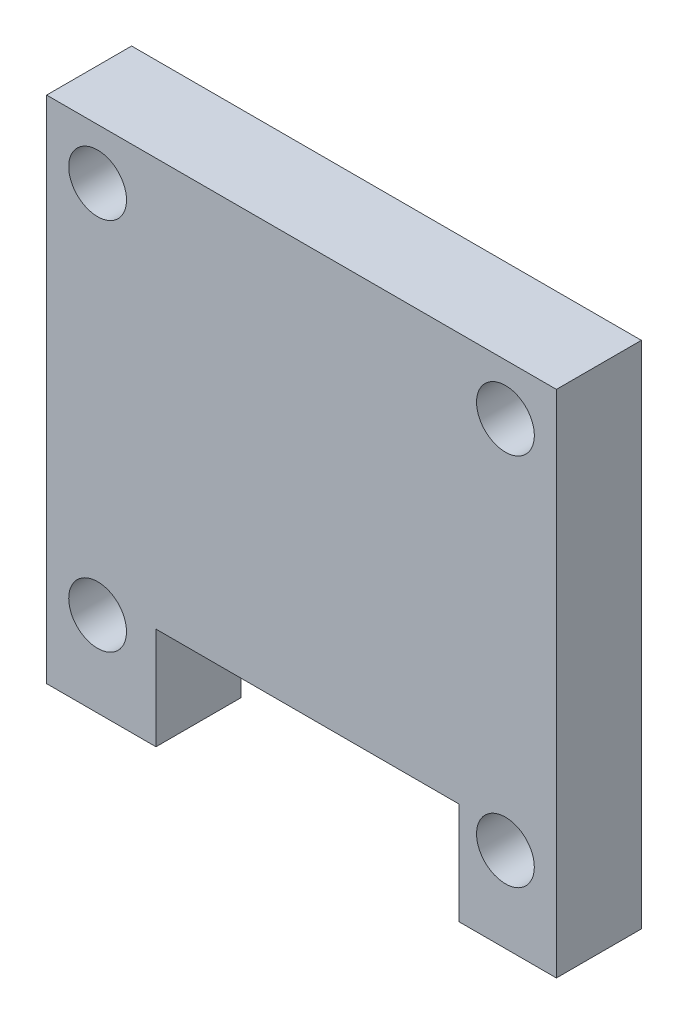
ISO-10303-21;
HEADER;
FILE_DESCRIPTION(('STEP AP214'),'2;1');
FILE_NAME('part.step','',(''),(''),'','','');
FILE_SCHEMA(('AUTOMOTIVE_DESIGN { 1 0 10303 214 1 1 1 1 }'));
ENDSEC;
DATA;
#1=APPLICATION_CONTEXT('core data for automotive mechanical design processes');
#2=APPLICATION_PROTOCOL_DEFINITION('international standard','automotive_design',2000,#1);
#3=PRODUCT_CONTEXT('',#1,'mechanical');
#4=PRODUCT('Part','Part','',(#3));
#5=PRODUCT_RELATED_PRODUCT_CATEGORY('part','',(#4));
#6=PRODUCT_DEFINITION_FORMATION('','',#4);
#7=PRODUCT_DEFINITION_CONTEXT('part definition',#1,'design');
#8=PRODUCT_DEFINITION('design','',#6,#7);
#9=PRODUCT_DEFINITION_SHAPE('','',#8);
#10=(LENGTH_UNIT() NAMED_UNIT(*) SI_UNIT(.MILLI.,.METRE.));
#11=(NAMED_UNIT(*) PLANE_ANGLE_UNIT() SI_UNIT($,.RADIAN.));
#12=(NAMED_UNIT(*) SI_UNIT($,.STERADIAN.) SOLID_ANGLE_UNIT());
#13=UNCERTAINTY_MEASURE_WITH_UNIT(LENGTH_MEASURE(1.E-05),#10,'distance_accuracy_value','');
#14=(GEOMETRIC_REPRESENTATION_CONTEXT(3) GLOBAL_UNCERTAINTY_ASSIGNED_CONTEXT((#13)) GLOBAL_UNIT_ASSIGNED_CONTEXT((#10,
#11,#12)) REPRESENTATION_CONTEXT('',''));
#15=CARTESIAN_POINT('',(0.,0.,0.));
#16=DIRECTION('',(0.,0.,1.));
#17=DIRECTION('',(1.,0.,0.));
#18=AXIS2_PLACEMENT_3D('',#15,#16,#17);
#19=CARTESIAN_POINT('',(0.,0.,5.));
#20=DIRECTION('',(0.,1.,0.));
#21=DIRECTION('',(0.,0.,1.));
#22=AXIS2_PLACEMENT_3D('',#19,#20,#21);
#23=PLANE('',#22);
#24=DIRECTION('',(1.,0.,0.));
#25=VECTOR('',#24,1.);
#26=CARTESIAN_POINT('',(0.,0.,0.));
#27=LINE('',#26,#25);
#28=CARTESIAN_POINT('',(0.,0.,0.));
#29=VERTEX_POINT('',#28);
#30=CARTESIAN_POINT('',(6.43470034297928,0.,0.));
#31=VERTEX_POINT('',#30);
#32=EDGE_CURVE('E182',#29,#31,#27,.T.);
#33=ORIENTED_EDGE('',*,*,#32,.T.);
#34=DIRECTION('',(0.,0.,1.));
#35=VECTOR('',#34,1.);
#36=CARTESIAN_POINT('',(6.43470034297928,0.,0.));
#37=LINE('',#36,#35);
#38=CARTESIAN_POINT('',(6.43470034297928,0.,5.));
#39=VERTEX_POINT('',#38);
#40=EDGE_CURVE('E167',#31,#39,#37,.T.);
#41=ORIENTED_EDGE('',*,*,#40,.T.);
#42=DIRECTION('',(1.,0.,0.));
#43=VECTOR('',#42,1.);
#44=CARTESIAN_POINT('',(0.,0.,5.));
#45=LINE('',#44,#43);
#46=CARTESIAN_POINT('',(0.,0.,5.));
#47=VERTEX_POINT('',#46);
#48=EDGE_CURVE('E220',#47,#39,#45,.T.);
#49=ORIENTED_EDGE('',*,*,#48,.F.);
#50=DIRECTION('',(0.,0.,-1.));
#51=VECTOR('',#50,1.);
#52=CARTESIAN_POINT('',(0.,0.,5.));
#53=LINE('',#52,#51);
#54=EDGE_CURVE('E117',#47,#29,#53,.T.);
#55=ORIENTED_EDGE('',*,*,#54,.T.);
#56=EDGE_LOOP('',(#33,#41,#49,#55));
#57=FACE_BOUND('',#56,.T.);
#58=ADVANCED_FACE('F93',(#57),#23,.F.);
#59=CARTESIAN_POINT('',(0.,0.,5.));
#60=DIRECTION('',(0.,0.,1.));
#61=DIRECTION('',(1.,0.,0.));
#62=AXIS2_PLACEMENT_3D('',#59,#60,#61);
#63=PLANE('',#62);
#64=DIRECTION('',(0.,-1.,0.));
#65=VECTOR('',#64,1.);
#66=CARTESIAN_POINT('',(6.43470034297928,0.,5.));
#67=LINE('',#66,#65);
#68=CARTESIAN_POINT('',(6.43470034297928,6.,5.));
#69=VERTEX_POINT('',#68);
#70=EDGE_CURVE('E173',#69,#39,#67,.T.);
#71=ORIENTED_EDGE('',*,*,#70,.F.);
#72=DIRECTION('',(-1.,0.,0.));
#73=VECTOR('',#72,1.);
#74=CARTESIAN_POINT('',(6.43470034297928,6.,5.));
#75=LINE('',#74,#73);
#76=CARTESIAN_POINT('',(24.2653481866811,6.,5.));
#77=VERTEX_POINT('',#76);
#78=EDGE_CURVE('E184',#77,#69,#75,.T.);
#79=ORIENTED_EDGE('',*,*,#78,.F.);
#80=DIRECTION('',(0.,1.,0.));
#81=VECTOR('',#80,1.);
#82=CARTESIAN_POINT('',(24.2653481866811,0.,5.));
#83=LINE('',#82,#81);
#84=CARTESIAN_POINT('',(24.2653481866811,0.,5.));
#85=VERTEX_POINT('',#84);
#86=EDGE_CURVE('E254',#85,#77,#83,.T.);
#87=ORIENTED_EDGE('',*,*,#86,.F.);
#88=CARTESIAN_POINT('',(30.,0.,5.));
#89=VERTEX_POINT('',#88);
#90=EDGE_CURVE('E144',#85,#89,#45,.T.);
#91=ORIENTED_EDGE('',*,*,#90,.T.);
#92=DIRECTION('',(0.,1.,0.));
#93=VECTOR('',#92,1.);
#94=CARTESIAN_POINT('',(30.,0.,5.));
#95=LINE('',#94,#93);
#96=CARTESIAN_POINT('',(30.,30.,5.));
#97=VERTEX_POINT('',#96);
#98=EDGE_CURVE('E219',#89,#97,#95,.T.);
#99=ORIENTED_EDGE('',*,*,#98,.T.);
#100=DIRECTION('',(1.,0.,0.));
#101=VECTOR('',#100,1.);
#102=CARTESIAN_POINT('',(0.,30.,5.));
#103=LINE('',#102,#101);
#104=CARTESIAN_POINT('',(0.,30.,5.));
#105=VERTEX_POINT('',#104);
#106=EDGE_CURVE('E209',#105,#97,#103,.T.);
#107=ORIENTED_EDGE('',*,*,#106,.F.);
#108=DIRECTION('',(0.,1.,0.));
#109=VECTOR('',#108,1.);
#110=CARTESIAN_POINT('',(0.,0.,5.));
#111=LINE('',#110,#109);
#112=EDGE_CURVE('E194',#47,#105,#111,.T.);
#113=ORIENTED_EDGE('',*,*,#112,.F.);
#114=ORIENTED_EDGE('',*,*,#48,.T.);
#115=EDGE_LOOP('',(#71,#79,#87,#91,#99,#107,#113,#114));
#116=FACE_BOUND('',#115,.T.);
#117=CARTESIAN_POINT('',(27.,27.,5.));
#118=DIRECTION('',(0.,0.,-1.));
#119=DIRECTION('',(-1.,0.,0.));
#120=AXIS2_PLACEMENT_3D('',#117,#118,#119);
#121=CIRCLE('',#120,1.7);
#122=CARTESIAN_POINT('',(25.3,27.,5.));
#123=VERTEX_POINT('',#122);
#124=EDGE_CURVE('E239',#123,#123,#121,.T.);
#125=ORIENTED_EDGE('',*,*,#124,.T.);
#126=EDGE_LOOP('',(#125));
#127=FACE_BOUND('',#126,.T.);
#128=CARTESIAN_POINT('',(3.,27.,5.));
#129=DIRECTION('',(0.,0.,1.));
#130=DIRECTION('',(1.,0.,0.));
#131=AXIS2_PLACEMENT_3D('',#128,#129,#130);
#132=CIRCLE('',#131,1.7);
#133=CARTESIAN_POINT('',(4.7,27.,5.));
#134=VERTEX_POINT('',#133);
#135=EDGE_CURVE('E192',#134,#134,#132,.T.);
#136=ORIENTED_EDGE('',*,*,#135,.F.);
#137=EDGE_LOOP('',(#136));
#138=FACE_BOUND('',#137,.T.);
#139=CARTESIAN_POINT('',(3.,5.,5.));
#140=DIRECTION('',(0.,0.,-1.));
#141=DIRECTION('',(-1.,0.,0.));
#142=AXIS2_PLACEMENT_3D('',#139,#140,#141);
#143=CIRCLE('',#142,1.7);
#144=CARTESIAN_POINT('',(1.3,5.,5.));
#145=VERTEX_POINT('',#144);
#146=EDGE_CURVE('E227',#145,#145,#143,.T.);
#147=ORIENTED_EDGE('',*,*,#146,.T.);
#148=EDGE_LOOP('',(#147));
#149=FACE_BOUND('',#148,.T.);
#150=CARTESIAN_POINT('',(27.,5.,5.));
#151=DIRECTION('',(0.,0.,1.));
#152=DIRECTION('',(1.,0.,0.));
#153=AXIS2_PLACEMENT_3D('',#150,#151,#152);
#154=CIRCLE('',#153,1.7);
#155=CARTESIAN_POINT('',(28.7,5.,5.));
#156=VERTEX_POINT('',#155);
#157=EDGE_CURVE('E233',#156,#156,#154,.T.);
#158=ORIENTED_EDGE('',*,*,#157,.F.);
#159=EDGE_LOOP('',(#158));
#160=FACE_BOUND('',#159,.T.);
#161=ADVANCED_FACE('F217',(#116,#127,#138,#149,#160),#63,.T.);
#162=CARTESIAN_POINT('',(0.,0.,0.));
#163=DIRECTION('',(0.,0.,1.));
#164=DIRECTION('',(1.,0.,0.));
#165=AXIS2_PLACEMENT_3D('',#162,#163,#164);
#166=PLANE('',#165);
#167=CARTESIAN_POINT('',(27.,27.,0.));
#168=DIRECTION('',(0.,0.,-1.));
#169=DIRECTION('',(-1.,0.,0.));
#170=AXIS2_PLACEMENT_3D('',#167,#168,#169);
#171=CIRCLE('',#170,1.7);
#172=CARTESIAN_POINT('',(25.3,27.,0.));
#173=VERTEX_POINT('',#172);
#174=EDGE_CURVE('E242',#173,#173,#171,.T.);
#175=ORIENTED_EDGE('',*,*,#174,.F.);
#176=EDGE_LOOP('',(#175));
#177=FACE_BOUND('',#176,.T.);
#178=CARTESIAN_POINT('',(3.,5.,0.));
#179=DIRECTION('',(0.,0.,-1.));
#180=DIRECTION('',(-1.,0.,0.));
#181=AXIS2_PLACEMENT_3D('',#178,#179,#180);
#182=CIRCLE('',#181,1.7);
#183=CARTESIAN_POINT('',(1.3,5.,0.));
#184=VERTEX_POINT('',#183);
#185=EDGE_CURVE('E230',#184,#184,#182,.T.);
#186=ORIENTED_EDGE('',*,*,#185,.F.);
#187=EDGE_LOOP('',(#186));
#188=FACE_BOUND('',#187,.T.);
#189=DIRECTION('',(-1.,0.,0.));
#190=VECTOR('',#189,1.);
#191=CARTESIAN_POINT('',(6.43470034297928,6.,0.));
#192=LINE('',#191,#190);
#193=CARTESIAN_POINT('',(24.2653481866811,6.,0.));
#194=VERTEX_POINT('',#193);
#195=CARTESIAN_POINT('',(6.43470034297928,6.,0.));
#196=VERTEX_POINT('',#195);
#197=EDGE_CURVE('E176',#194,#196,#192,.T.);
#198=ORIENTED_EDGE('',*,*,#197,.T.);
#199=DIRECTION('',(0.,-1.,0.));
#200=VECTOR('',#199,1.);
#201=CARTESIAN_POINT('',(6.43470034297928,0.,0.));
#202=LINE('',#201,#200);
#203=EDGE_CURVE('E170',#196,#31,#202,.T.);
#204=ORIENTED_EDGE('',*,*,#203,.T.);
#205=ORIENTED_EDGE('',*,*,#32,.F.);
#206=DIRECTION('',(0.,1.,0.));
#207=VECTOR('',#206,1.);
#208=CARTESIAN_POINT('',(0.,0.,0.));
#209=LINE('',#208,#207);
#210=CARTESIAN_POINT('',(0.,30.,0.));
#211=VERTEX_POINT('',#210);
#212=EDGE_CURVE('E199',#29,#211,#209,.T.);
#213=ORIENTED_EDGE('',*,*,#212,.T.);
#214=DIRECTION('',(1.,0.,0.));
#215=VECTOR('',#214,1.);
#216=CARTESIAN_POINT('',(0.,30.,0.));
#217=LINE('',#216,#215);
#218=CARTESIAN_POINT('',(30.,30.,0.));
#219=VERTEX_POINT('',#218);
#220=EDGE_CURVE('E190',#211,#219,#217,.T.);
#221=ORIENTED_EDGE('',*,*,#220,.T.);
#222=DIRECTION('',(0.,1.,0.));
#223=VECTOR('',#222,1.);
#224=CARTESIAN_POINT('',(30.,0.,0.));
#225=LINE('',#224,#223);
#226=CARTESIAN_POINT('',(30.,0.,0.));
#227=VERTEX_POINT('',#226);
#228=EDGE_CURVE('E186',#227,#219,#225,.T.);
#229=ORIENTED_EDGE('',*,*,#228,.F.);
#230=CARTESIAN_POINT('',(24.2653481866811,0.,0.));
#231=VERTEX_POINT('',#230);
#232=EDGE_CURVE('E187',#231,#227,#27,.T.);
#233=ORIENTED_EDGE('',*,*,#232,.F.);
#234=DIRECTION('',(0.,1.,0.));
#235=VECTOR('',#234,1.);
#236=CARTESIAN_POINT('',(24.2653481866811,0.,0.));
#237=LINE('',#236,#235);
#238=EDGE_CURVE('E108',#231,#194,#237,.T.);
#239=ORIENTED_EDGE('',*,*,#238,.T.);
#240=EDGE_LOOP('',(#198,#204,#205,#213,#221,#229,#233,#239));
#241=FACE_BOUND('',#240,.T.);
#242=CARTESIAN_POINT('',(3.,27.,0.));
#243=DIRECTION('',(0.,0.,1.));
#244=DIRECTION('',(1.,0.,0.));
#245=AXIS2_PLACEMENT_3D('',#242,#243,#244);
#246=CIRCLE('',#245,1.7);
#247=CARTESIAN_POINT('',(4.7,27.,0.));
#248=VERTEX_POINT('',#247);
#249=EDGE_CURVE('E224',#248,#248,#246,.T.);
#250=ORIENTED_EDGE('',*,*,#249,.T.);
#251=EDGE_LOOP('',(#250));
#252=FACE_BOUND('',#251,.T.);
#253=CARTESIAN_POINT('',(27.,5.,0.));
#254=DIRECTION('',(0.,0.,1.));
#255=DIRECTION('',(1.,0.,0.));
#256=AXIS2_PLACEMENT_3D('',#253,#254,#255);
#257=CIRCLE('',#256,1.7);
#258=CARTESIAN_POINT('',(28.7,5.,0.));
#259=VERTEX_POINT('',#258);
#260=EDGE_CURVE('E236',#259,#259,#257,.T.);
#261=ORIENTED_EDGE('',*,*,#260,.T.);
#262=EDGE_LOOP('',(#261));
#263=FACE_BOUND('',#262,.T.);
#264=ADVANCED_FACE('F179',(#177,#188,#241,#252,#263),#166,.F.);
#265=ORIENTED_EDGE('',*,*,#90,.F.);
#266=DIRECTION('',(0.,0.,1.));
#267=VECTOR('',#266,1.);
#268=CARTESIAN_POINT('',(24.2653481866811,0.,0.));
#269=LINE('',#268,#267);
#270=EDGE_CURVE('E175',#231,#85,#269,.T.);
#271=ORIENTED_EDGE('',*,*,#270,.F.);
#272=ORIENTED_EDGE('',*,*,#232,.T.);
#273=DIRECTION('',(0.,0.,-1.));
#274=VECTOR('',#273,1.);
#275=CARTESIAN_POINT('',(30.,0.,5.));
#276=LINE('',#275,#274);
#277=EDGE_CURVE('E12',#89,#227,#276,.T.);
#278=ORIENTED_EDGE('',*,*,#277,.F.);
#279=EDGE_LOOP('',(#265,#271,#272,#278));
#280=FACE_BOUND('',#279,.T.);
#281=ADVANCED_FACE('F95',(#280),#23,.F.);
#282=CARTESIAN_POINT('',(30.,0.,5.));
#283=DIRECTION('',(-1.,0.,0.));
#284=DIRECTION('',(0.,-1.,0.));
#285=AXIS2_PLACEMENT_3D('',#282,#283,#284);
#286=PLANE('',#285);
#287=ORIENTED_EDGE('',*,*,#228,.T.);
#288=DIRECTION('',(0.,0.,-1.));
#289=VECTOR('',#288,1.);
#290=CARTESIAN_POINT('',(30.,30.,5.));
#291=LINE('',#290,#289);
#292=EDGE_CURVE('E101',#97,#219,#291,.T.);
#293=ORIENTED_EDGE('',*,*,#292,.F.);
#294=ORIENTED_EDGE('',*,*,#98,.F.);
#295=ORIENTED_EDGE('',*,*,#277,.T.);
#296=EDGE_LOOP('',(#287,#293,#294,#295));
#297=FACE_BOUND('',#296,.T.);
#298=ADVANCED_FACE('F212',(#297),#286,.F.);
#299=CARTESIAN_POINT('',(0.,30.,5.));
#300=DIRECTION('',(0.,1.,0.));
#301=DIRECTION('',(0.,0.,1.));
#302=AXIS2_PLACEMENT_3D('',#299,#300,#301);
#303=PLANE('',#302);
#304=ORIENTED_EDGE('',*,*,#220,.F.);
#305=DIRECTION('',(0.,0.,-1.));
#306=VECTOR('',#305,1.);
#307=CARTESIAN_POINT('',(0.,30.,5.));
#308=LINE('',#307,#306);
#309=EDGE_CURVE('E202',#105,#211,#308,.T.);
#310=ORIENTED_EDGE('',*,*,#309,.F.);
#311=ORIENTED_EDGE('',*,*,#106,.T.);
#312=ORIENTED_EDGE('',*,*,#292,.T.);
#313=EDGE_LOOP('',(#304,#310,#311,#312));
#314=FACE_BOUND('',#313,.T.);
#315=ADVANCED_FACE('F207',(#314),#303,.T.);
#316=CARTESIAN_POINT('',(0.,0.,5.));
#317=DIRECTION('',(-1.,0.,0.));
#318=DIRECTION('',(0.,-1.,0.));
#319=AXIS2_PLACEMENT_3D('',#316,#317,#318);
#320=PLANE('',#319);
#321=ORIENTED_EDGE('',*,*,#212,.F.);
#322=ORIENTED_EDGE('',*,*,#54,.F.);
#323=ORIENTED_EDGE('',*,*,#112,.T.);
#324=ORIENTED_EDGE('',*,*,#309,.T.);
#325=EDGE_LOOP('',(#321,#322,#323,#324));
#326=FACE_BOUND('',#325,.T.);
#327=ADVANCED_FACE('F215',(#326),#320,.T.);
#328=CARTESIAN_POINT('',(3.,27.,5.));
#329=DIRECTION('',(0.,0.,-1.));
#330=DIRECTION('',(-1.,0.,0.));
#331=AXIS2_PLACEMENT_3D('',#328,#329,#330);
#332=CYLINDRICAL_SURFACE('',#331,1.7);
#333=ORIENTED_EDGE('',*,*,#135,.T.);
#334=EDGE_LOOP('',(#333));
#335=FACE_BOUND('',#334,.T.);
#336=ORIENTED_EDGE('',*,*,#249,.F.);
#337=EDGE_LOOP('',(#336));
#338=FACE_BOUND('',#337,.T.);
#339=ADVANCED_FACE('F293',(#335,#338),#332,.F.);
#340=CARTESIAN_POINT('',(3.,5.,5.));
#341=DIRECTION('',(0.,0.,-1.));
#342=DIRECTION('',(-1.,0.,0.));
#343=AXIS2_PLACEMENT_3D('',#340,#341,#342);
#344=CYLINDRICAL_SURFACE('',#343,1.7);
#345=ORIENTED_EDGE('',*,*,#146,.F.);
#346=EDGE_LOOP('',(#345));
#347=FACE_BOUND('',#346,.T.);
#348=ORIENTED_EDGE('',*,*,#185,.T.);
#349=EDGE_LOOP('',(#348));
#350=FACE_BOUND('',#349,.T.);
#351=ADVANCED_FACE('F309',(#347,#350),#344,.F.);
#352=CARTESIAN_POINT('',(27.,5.,5.));
#353=DIRECTION('',(0.,0.,-1.));
#354=DIRECTION('',(-1.,0.,0.));
#355=AXIS2_PLACEMENT_3D('',#352,#353,#354);
#356=CYLINDRICAL_SURFACE('',#355,1.7);
#357=ORIENTED_EDGE('',*,*,#157,.T.);
#358=EDGE_LOOP('',(#357));
#359=FACE_BOUND('',#358,.T.);
#360=ORIENTED_EDGE('',*,*,#260,.F.);
#361=EDGE_LOOP('',(#360));
#362=FACE_BOUND('',#361,.T.);
#363=ADVANCED_FACE('F316',(#359,#362),#356,.F.);
#364=CARTESIAN_POINT('',(27.,27.,5.));
#365=DIRECTION('',(0.,0.,-1.));
#366=DIRECTION('',(-1.,0.,0.));
#367=AXIS2_PLACEMENT_3D('',#364,#365,#366);
#368=CYLINDRICAL_SURFACE('',#367,1.7);
#369=ORIENTED_EDGE('',*,*,#124,.F.);
#370=EDGE_LOOP('',(#369));
#371=FACE_BOUND('',#370,.T.);
#372=ORIENTED_EDGE('',*,*,#174,.T.);
#373=EDGE_LOOP('',(#372));
#374=FACE_BOUND('',#373,.T.);
#375=ADVANCED_FACE('F271',(#371,#374),#368,.F.);
#376=CARTESIAN_POINT('',(6.43470034297928,0.,0.));
#377=DIRECTION('',(-1.,0.,0.));
#378=DIRECTION('',(0.,0.,1.));
#379=AXIS2_PLACEMENT_3D('',#376,#377,#378);
#380=PLANE('',#379);
#381=ORIENTED_EDGE('',*,*,#70,.T.);
#382=ORIENTED_EDGE('',*,*,#40,.F.);
#383=ORIENTED_EDGE('',*,*,#203,.F.);
#384=DIRECTION('',(0.,0.,1.));
#385=VECTOR('',#384,1.);
#386=CARTESIAN_POINT('',(6.43470034297928,6.,0.));
#387=LINE('',#386,#385);
#388=EDGE_CURVE('E245',#196,#69,#387,.T.);
#389=ORIENTED_EDGE('',*,*,#388,.T.);
#390=EDGE_LOOP('',(#381,#382,#383,#389));
#391=FACE_BOUND('',#390,.T.);
#392=ADVANCED_FACE('F169',(#391),#380,.F.);
#393=CARTESIAN_POINT('',(6.43470034297928,6.,0.));
#394=DIRECTION('',(0.,1.,0.));
#395=DIRECTION('',(0.,0.,1.));
#396=AXIS2_PLACEMENT_3D('',#393,#394,#395);
#397=PLANE('',#396);
#398=ORIENTED_EDGE('',*,*,#78,.T.);
#399=ORIENTED_EDGE('',*,*,#388,.F.);
#400=ORIENTED_EDGE('',*,*,#197,.F.);
#401=DIRECTION('',(0.,0.,1.));
#402=VECTOR('',#401,1.);
#403=CARTESIAN_POINT('',(24.2653481866811,6.,0.));
#404=LINE('',#403,#402);
#405=EDGE_CURVE('E249',#194,#77,#404,.T.);
#406=ORIENTED_EDGE('',*,*,#405,.T.);
#407=EDGE_LOOP('',(#398,#399,#400,#406));
#408=FACE_BOUND('',#407,.T.);
#409=ADVANCED_FACE('F263',(#408),#397,.F.);
#410=CARTESIAN_POINT('',(24.2653481866811,0.,0.));
#411=DIRECTION('',(1.,0.,0.));
#412=DIRECTION('',(0.,0.,-1.));
#413=AXIS2_PLACEMENT_3D('',#410,#411,#412);
#414=PLANE('',#413);
#415=ORIENTED_EDGE('',*,*,#86,.T.);
#416=ORIENTED_EDGE('',*,*,#405,.F.);
#417=ORIENTED_EDGE('',*,*,#238,.F.);
#418=ORIENTED_EDGE('',*,*,#270,.T.);
#419=EDGE_LOOP('',(#415,#416,#417,#418));
#420=FACE_BOUND('',#419,.T.);
#421=ADVANCED_FACE('F260',(#420),#414,.F.);
#422=CLOSED_SHELL('',(#58,#161,#264,#281,#298,#315,#327,#339,#351,#363,#375,#392,#409,#421));
#423=MANIFOLD_SOLID_BREP('B2',#422);
#424=ADVANCED_BREP_SHAPE_REPRESENTATION('',(#18,#423),#14);
#425=SHAPE_DEFINITION_REPRESENTATION(#9,#424);
ENDSEC;
END-ISO-10303-21;
